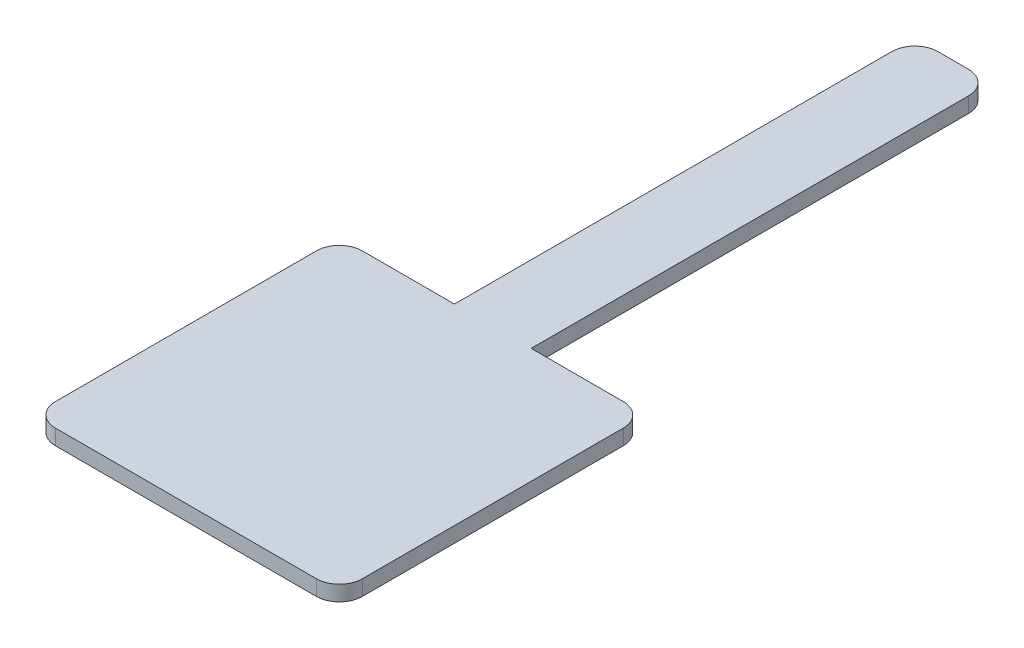
ISO-10303-21;
HEADER;
FILE_DESCRIPTION(('STEP AP214'),'2;1');
FILE_NAME('part.step','',(''),(''),'','','');
FILE_SCHEMA(('AUTOMOTIVE_DESIGN { 1 0 10303 214 1 1 1 1 }'));
ENDSEC;
DATA;
#1=APPLICATION_CONTEXT('core data for automotive mechanical design processes');
#2=APPLICATION_PROTOCOL_DEFINITION('international standard','automotive_design',2000,#1);
#3=PRODUCT_CONTEXT('',#1,'mechanical');
#4=PRODUCT('Part','Part','',(#3));
#5=PRODUCT_RELATED_PRODUCT_CATEGORY('part','',(#4));
#6=PRODUCT_DEFINITION_FORMATION('','',#4);
#7=PRODUCT_DEFINITION_CONTEXT('part definition',#1,'design');
#8=PRODUCT_DEFINITION('design','',#6,#7);
#9=PRODUCT_DEFINITION_SHAPE('','',#8);
#10=(LENGTH_UNIT() NAMED_UNIT(*) SI_UNIT(.MILLI.,.METRE.));
#11=(NAMED_UNIT(*) PLANE_ANGLE_UNIT() SI_UNIT($,.RADIAN.));
#12=(NAMED_UNIT(*) SI_UNIT($,.STERADIAN.) SOLID_ANGLE_UNIT());
#13=UNCERTAINTY_MEASURE_WITH_UNIT(LENGTH_MEASURE(1.E-05),#10,'distance_accuracy_value','');
#14=(GEOMETRIC_REPRESENTATION_CONTEXT(3) GLOBAL_UNCERTAINTY_ASSIGNED_CONTEXT((#13)) GLOBAL_UNIT_ASSIGNED_CONTEXT((#10,
#11,#12)) REPRESENTATION_CONTEXT('',''));
#15=CARTESIAN_POINT('',(0.,0.,0.));
#16=DIRECTION('',(0.,0.,1.));
#17=DIRECTION('',(1.,0.,0.));
#18=AXIS2_PLACEMENT_3D('',#15,#16,#17);
#19=CARTESIAN_POINT('',(-24.8040067689601,1.,0.720140696045538));
#20=DIRECTION('',(1.,0.,0.));
#21=DIRECTION('',(0.,0.,-1.));
#22=AXIS2_PLACEMENT_3D('',#19,#20,#21);
#23=PLANE('',#22);
#24=DIRECTION('',(0.,0.,1.));
#25=VECTOR('',#24,1.);
#26=CARTESIAN_POINT('',(-24.8040067689601,1.,0.720140696045538));
#27=LINE('',#26,#25);
#28=CARTESIAN_POINT('',(-24.8040067689601,1.,2.22014069604554));
#29=VERTEX_POINT('',#28);
#30=CARTESIAN_POINT('',(-24.8040067689601,1.,19.2201406960455));
#31=VERTEX_POINT('',#30);
#32=EDGE_CURVE('E213',#29,#31,#27,.T.);
#33=ORIENTED_EDGE('',*,*,#32,.F.);
#34=DIRECTION('',(0.,-1.,0.));
#35=VECTOR('',#34,1.);
#36=CARTESIAN_POINT('',(-24.8040067689601,1.,2.22014069604554));
#37=LINE('',#36,#35);
#38=CARTESIAN_POINT('',(-24.8040067689601,0.,2.22014069604554));
#39=VERTEX_POINT('',#38);
#40=EDGE_CURVE('E267',#29,#39,#37,.T.);
#41=ORIENTED_EDGE('',*,*,#40,.T.);
#42=DIRECTION('',(0.,0.,1.));
#43=VECTOR('',#42,1.);
#44=CARTESIAN_POINT('',(-24.8040067689601,0.,0.720140696045538));
#45=LINE('',#44,#43);
#46=CARTESIAN_POINT('',(-24.8040067689601,0.,19.2201406960455));
#47=VERTEX_POINT('',#46);
#48=EDGE_CURVE('E186',#39,#47,#45,.T.);
#49=ORIENTED_EDGE('',*,*,#48,.T.);
#50=DIRECTION('',(0.,-1.,0.));
#51=VECTOR('',#50,1.);
#52=CARTESIAN_POINT('',(-24.8040067689601,1.,19.2201406960455));
#53=LINE('',#52,#51);
#54=EDGE_CURVE('E264',#47,#31,#53,.F.);
#55=ORIENTED_EDGE('',*,*,#54,.T.);
#56=EDGE_LOOP('',(#33,#41,#49,#55));
#57=FACE_BOUND('',#56,.T.);
#58=ADVANCED_FACE('F43',(#57),#23,.F.);
#59=CARTESIAN_POINT('',(-24.8040067689601,1.,20.7201406960455));
#60=DIRECTION('',(0.,0.,-1.));
#61=DIRECTION('',(-1.,0.,0.));
#62=AXIS2_PLACEMENT_3D('',#59,#60,#61);
#63=PLANE('',#62);
#64=DIRECTION('',(1.,0.,0.));
#65=VECTOR('',#64,1.);
#66=CARTESIAN_POINT('',(-24.8040067689601,0.,20.7201406960455));
#67=LINE('',#66,#65);
#68=CARTESIAN_POINT('',(-23.3040067689601,0.,20.7201406960455));
#69=VERTEX_POINT('',#68);
#70=CARTESIAN_POINT('',(-6.30400676896015,0.,20.7201406960455));
#71=VERTEX_POINT('',#70);
#72=EDGE_CURVE('E190',#69,#71,#67,.T.);
#73=ORIENTED_EDGE('',*,*,#72,.T.);
#74=DIRECTION('',(0.,-1.,0.));
#75=VECTOR('',#74,1.);
#76=CARTESIAN_POINT('',(-6.30400676896015,1.,20.7201406960455));
#77=LINE('',#76,#75);
#78=CARTESIAN_POINT('',(-6.30400676896015,1.,20.7201406960455));
#79=VERTEX_POINT('',#78);
#80=EDGE_CURVE('E11',#71,#79,#77,.F.);
#81=ORIENTED_EDGE('',*,*,#80,.T.);
#82=DIRECTION('',(1.,0.,0.));
#83=VECTOR('',#82,1.);
#84=CARTESIAN_POINT('',(-24.8040067689601,1.,20.7201406960455));
#85=LINE('',#84,#83);
#86=CARTESIAN_POINT('',(-23.3040067689601,1.,20.7201406960455));
#87=VERTEX_POINT('',#86);
#88=EDGE_CURVE('E291',#87,#79,#85,.T.);
#89=ORIENTED_EDGE('',*,*,#88,.F.);
#90=DIRECTION('',(0.,-1.,0.));
#91=VECTOR('',#90,1.);
#92=CARTESIAN_POINT('',(-23.3040067689601,1.,20.7201406960455));
#93=LINE('',#92,#91);
#94=EDGE_CURVE('E52',#87,#69,#93,.T.);
#95=ORIENTED_EDGE('',*,*,#94,.T.);
#96=EDGE_LOOP('',(#73,#81,#89,#95));
#97=FACE_BOUND('',#96,.T.);
#98=ADVANCED_FACE('F288',(#97),#63,.F.);
#99=CARTESIAN_POINT('',(-4.80400676896015,1.,20.7201406960455));
#100=DIRECTION('',(-1.,0.,0.));
#101=DIRECTION('',(0.,0.,1.));
#102=AXIS2_PLACEMENT_3D('',#99,#100,#101);
#103=PLANE('',#102);
#104=DIRECTION('',(0.,0.,-1.));
#105=VECTOR('',#104,1.);
#106=CARTESIAN_POINT('',(-4.80400676896015,0.,20.7201406960455));
#107=LINE('',#106,#105);
#108=CARTESIAN_POINT('',(-4.80400676896015,0.,19.2201406960455));
#109=VERTEX_POINT('',#108);
#110=CARTESIAN_POINT('',(-4.80400676896015,0.,2.22014069604554));
#111=VERTEX_POINT('',#110);
#112=EDGE_CURVE('E194',#109,#111,#107,.T.);
#113=ORIENTED_EDGE('',*,*,#112,.T.);
#114=DIRECTION('',(0.,-1.,0.));
#115=VECTOR('',#114,1.);
#116=CARTESIAN_POINT('',(-4.80400676896015,1.,2.22014069604554));
#117=LINE('',#116,#115);
#118=CARTESIAN_POINT('',(-4.80400676896015,1.,2.22014069604554));
#119=VERTEX_POINT('',#118);
#120=EDGE_CURVE('E280',#111,#119,#117,.F.);
#121=ORIENTED_EDGE('',*,*,#120,.T.);
#122=DIRECTION('',(0.,0.,-1.));
#123=VECTOR('',#122,1.);
#124=CARTESIAN_POINT('',(-4.80400676896015,1.,20.7201406960455));
#125=LINE('',#124,#123);
#126=CARTESIAN_POINT('',(-4.80400676896015,1.,19.2201406960455));
#127=VERTEX_POINT('',#126);
#128=EDGE_CURVE('E160',#127,#119,#125,.T.);
#129=ORIENTED_EDGE('',*,*,#128,.F.);
#130=DIRECTION('',(0.,-1.,0.));
#131=VECTOR('',#130,1.);
#132=CARTESIAN_POINT('',(-4.80400676896015,1.,19.2201406960455));
#133=LINE('',#132,#131);
#134=EDGE_CURVE('E276',#127,#109,#133,.T.);
#135=ORIENTED_EDGE('',*,*,#134,.T.);
#136=EDGE_LOOP('',(#113,#121,#129,#135));
#137=FACE_BOUND('',#136,.T.);
#138=ADVANCED_FACE('F305',(#137),#103,.F.);
#139=CARTESIAN_POINT('',(-4.80400676896015,1.,0.720140696045538));
#140=DIRECTION('',(0.,0.,1.));
#141=DIRECTION('',(1.,0.,0.));
#142=AXIS2_PLACEMENT_3D('',#139,#140,#141);
#143=PLANE('',#142);
#144=DIRECTION('',(-1.,0.,0.));
#145=VECTOR('',#144,1.);
#146=CARTESIAN_POINT('',(-4.80400676896015,1.,0.720140696045538));
#147=LINE('',#146,#145);
#148=CARTESIAN_POINT('',(-6.30400676896015,1.,0.720140696045538));
#149=VERTEX_POINT('',#148);
#150=CARTESIAN_POINT('',(-12.3040067689601,1.,0.720140696045539));
#151=VERTEX_POINT('',#150);
#152=EDGE_CURVE('E147',#149,#151,#147,.T.);
#153=ORIENTED_EDGE('',*,*,#152,.F.);
#154=DIRECTION('',(0.,-1.,0.));
#155=VECTOR('',#154,1.);
#156=CARTESIAN_POINT('',(-6.30400676896015,1.,0.720140696045538));
#157=LINE('',#156,#155);
#158=CARTESIAN_POINT('',(-6.30400676896015,0.,0.720140696045538));
#159=VERTEX_POINT('',#158);
#160=EDGE_CURVE('E273',#149,#159,#157,.T.);
#161=ORIENTED_EDGE('',*,*,#160,.T.);
#162=DIRECTION('',(-1.,0.,0.));
#163=VECTOR('',#162,1.);
#164=CARTESIAN_POINT('',(-4.80400676896015,0.,0.720140696045538));
#165=LINE('',#164,#163);
#166=CARTESIAN_POINT('',(-12.3040067689601,0.,0.720140696045539));
#167=VERTEX_POINT('',#166);
#168=EDGE_CURVE('E166',#159,#167,#165,.T.);
#169=ORIENTED_EDGE('',*,*,#168,.T.);
#170=DIRECTION('',(0.,-1.,0.));
#171=VECTOR('',#170,1.);
#172=CARTESIAN_POINT('',(-12.3040067689601,1.,0.720140696045539));
#173=LINE('',#172,#171);
#174=EDGE_CURVE('E163',#151,#167,#173,.T.);
#175=ORIENTED_EDGE('',*,*,#174,.F.);
#176=EDGE_LOOP('',(#153,#161,#169,#175));
#177=FACE_BOUND('',#176,.T.);
#178=ADVANCED_FACE('F164',(#177),#143,.F.);
#179=CARTESIAN_POINT('',(-12.3040067689601,1.,0.720140696045539));
#180=DIRECTION('',(-1.,0.,0.));
#181=DIRECTION('',(0.,0.,1.));
#182=AXIS2_PLACEMENT_3D('',#179,#180,#181);
#183=PLANE('',#182);
#184=DIRECTION('',(0.,0.,-1.));
#185=VECTOR('',#184,1.);
#186=CARTESIAN_POINT('',(-12.3040067689601,0.,0.720140696045539));
#187=LINE('',#186,#185);
#188=CARTESIAN_POINT('',(-12.3040067689601,0.,-27.7798593039545));
#189=VERTEX_POINT('',#188);
#190=EDGE_CURVE('E200',#167,#189,#187,.T.);
#191=ORIENTED_EDGE('',*,*,#190,.T.);
#192=DIRECTION('',(0.,-1.,0.));
#193=VECTOR('',#192,1.);
#194=CARTESIAN_POINT('',(-12.3040067689601,1.,-27.7798593039545));
#195=LINE('',#194,#193);
#196=CARTESIAN_POINT('',(-12.3040067689601,1.,-27.7798593039545));
#197=VERTEX_POINT('',#196);
#198=EDGE_CURVE('E67',#189,#197,#195,.F.);
#199=ORIENTED_EDGE('',*,*,#198,.T.);
#200=DIRECTION('',(0.,0.,-1.));
#201=VECTOR('',#200,1.);
#202=CARTESIAN_POINT('',(-12.3040067689601,1.,0.720140696045539));
#203=LINE('',#202,#201);
#204=EDGE_CURVE('E151',#151,#197,#203,.T.);
#205=ORIENTED_EDGE('',*,*,#204,.F.);
#206=ORIENTED_EDGE('',*,*,#174,.T.);
#207=EDGE_LOOP('',(#191,#199,#205,#206));
#208=FACE_BOUND('',#207,.T.);
#209=ADVANCED_FACE('F172',(#208),#183,.F.);
#210=CARTESIAN_POINT('',(-12.3040067689601,1.,-29.2798593039545));
#211=DIRECTION('',(0.,0.,1.));
#212=DIRECTION('',(1.,0.,0.));
#213=AXIS2_PLACEMENT_3D('',#210,#211,#212);
#214=PLANE('',#213);
#215=DIRECTION('',(-1.,0.,0.));
#216=VECTOR('',#215,1.);
#217=CARTESIAN_POINT('',(-12.3040067689601,0.,-29.2798593039545));
#218=LINE('',#217,#216);
#219=CARTESIAN_POINT('',(-13.8040067689601,0.,-29.2798593039545));
#220=VERTEX_POINT('',#219);
#221=CARTESIAN_POINT('',(-15.8040067689601,0.,-29.2798593039545));
#222=VERTEX_POINT('',#221);
#223=EDGE_CURVE('E203',#220,#222,#218,.T.);
#224=ORIENTED_EDGE('',*,*,#223,.T.);
#225=DIRECTION('',(0.,-1.,0.));
#226=VECTOR('',#225,1.);
#227=CARTESIAN_POINT('',(-15.8040067689601,1.,-29.2798593039545));
#228=LINE('',#227,#226);
#229=CARTESIAN_POINT('',(-15.8040067689601,1.,-29.2798593039545));
#230=VERTEX_POINT('',#229);
#231=EDGE_CURVE('E242',#222,#230,#228,.F.);
#232=ORIENTED_EDGE('',*,*,#231,.T.);
#233=DIRECTION('',(-1.,0.,0.));
#234=VECTOR('',#233,1.);
#235=CARTESIAN_POINT('',(-12.3040067689601,1.,-29.2798593039545));
#236=LINE('',#235,#234);
#237=CARTESIAN_POINT('',(-13.8040067689601,1.,-29.2798593039545));
#238=VERTEX_POINT('',#237);
#239=EDGE_CURVE('E174',#238,#230,#236,.T.);
#240=ORIENTED_EDGE('',*,*,#239,.F.);
#241=DIRECTION('',(0.,-1.,0.));
#242=VECTOR('',#241,1.);
#243=CARTESIAN_POINT('',(-13.8040067689601,1.,-29.2798593039545));
#244=LINE('',#243,#242);
#245=EDGE_CURVE('E238',#238,#220,#244,.T.);
#246=ORIENTED_EDGE('',*,*,#245,.T.);
#247=EDGE_LOOP('',(#224,#232,#240,#246));
#248=FACE_BOUND('',#247,.T.);
#249=ADVANCED_FACE('F359',(#248),#214,.F.);
#250=CARTESIAN_POINT('',(-17.3040067689601,1.,-29.2798593039545));
#251=DIRECTION('',(1.,0.,0.));
#252=DIRECTION('',(0.,0.,-1.));
#253=AXIS2_PLACEMENT_3D('',#250,#251,#252);
#254=PLANE('',#253);
#255=DIRECTION('',(0.,0.,1.));
#256=VECTOR('',#255,1.);
#257=CARTESIAN_POINT('',(-17.3040067689601,1.,-29.2798593039545));
#258=LINE('',#257,#256);
#259=CARTESIAN_POINT('',(-17.3040067689601,1.,-27.7798593039545));
#260=VERTEX_POINT('',#259);
#261=CARTESIAN_POINT('',(-17.3040067689601,1.,0.720140696045538));
#262=VERTEX_POINT('',#261);
#263=EDGE_CURVE('E177',#260,#262,#258,.T.);
#264=ORIENTED_EDGE('',*,*,#263,.F.);
#265=DIRECTION('',(0.,-1.,0.));
#266=VECTOR('',#265,1.);
#267=CARTESIAN_POINT('',(-17.3040067689601,1.,-27.7798593039545));
#268=LINE('',#267,#266);
#269=CARTESIAN_POINT('',(-17.3040067689601,0.,-27.7798593039545));
#270=VERTEX_POINT('',#269);
#271=EDGE_CURVE('E169',#260,#270,#268,.T.);
#272=ORIENTED_EDGE('',*,*,#271,.T.);
#273=DIRECTION('',(0.,0.,1.));
#274=VECTOR('',#273,1.);
#275=CARTESIAN_POINT('',(-17.3040067689601,0.,-29.2798593039545));
#276=LINE('',#275,#274);
#277=CARTESIAN_POINT('',(-17.3040067689601,0.,0.720140696045538));
#278=VERTEX_POINT('',#277);
#279=EDGE_CURVE('E207',#270,#278,#276,.T.);
#280=ORIENTED_EDGE('',*,*,#279,.T.);
#281=DIRECTION('',(0.,-1.,0.));
#282=VECTOR('',#281,1.);
#283=CARTESIAN_POINT('',(-17.3040067689601,1.,0.720140696045538));
#284=LINE('',#283,#282);
#285=EDGE_CURVE('E170',#262,#278,#284,.T.);
#286=ORIENTED_EDGE('',*,*,#285,.F.);
#287=EDGE_LOOP('',(#264,#272,#280,#286));
#288=FACE_BOUND('',#287,.T.);
#289=ADVANCED_FACE('F356',(#288),#254,.F.);
#290=CARTESIAN_POINT('',(-17.3040067689601,1.,0.720140696045538));
#291=DIRECTION('',(0.,0.,1.));
#292=DIRECTION('',(1.,0.,0.));
#293=AXIS2_PLACEMENT_3D('',#290,#291,#292);
#294=PLANE('',#293);
#295=DIRECTION('',(-1.,0.,0.));
#296=VECTOR('',#295,1.);
#297=CARTESIAN_POINT('',(-17.3040067689601,0.,0.720140696045538));
#298=LINE('',#297,#296);
#299=CARTESIAN_POINT('',(-23.3040067689601,0.,0.720140696045538));
#300=VERTEX_POINT('',#299);
#301=EDGE_CURVE('E210',#278,#300,#298,.T.);
#302=ORIENTED_EDGE('',*,*,#301,.T.);
#303=DIRECTION('',(0.,-1.,0.));
#304=VECTOR('',#303,1.);
#305=CARTESIAN_POINT('',(-23.3040067689601,1.,0.720140696045538));
#306=LINE('',#305,#304);
#307=CARTESIAN_POINT('',(-23.3040067689601,1.,0.720140696045538));
#308=VERTEX_POINT('',#307);
#309=EDGE_CURVE('E59',#300,#308,#306,.F.);
#310=ORIENTED_EDGE('',*,*,#309,.T.);
#311=DIRECTION('',(-1.,0.,0.));
#312=VECTOR('',#311,1.);
#313=CARTESIAN_POINT('',(-17.3040067689601,1.,0.720140696045538));
#314=LINE('',#313,#312);
#315=EDGE_CURVE('E183',#262,#308,#314,.T.);
#316=ORIENTED_EDGE('',*,*,#315,.F.);
#317=ORIENTED_EDGE('',*,*,#285,.T.);
#318=EDGE_LOOP('',(#302,#310,#316,#317));
#319=FACE_BOUND('',#318,.T.);
#320=ADVANCED_FACE('F320',(#319),#294,.F.);
#321=CARTESIAN_POINT('',(0.,1.,0.));
#322=DIRECTION('',(0.,1.,0.));
#323=DIRECTION('',(0.,0.,1.));
#324=AXIS2_PLACEMENT_3D('',#321,#322,#323);
#325=PLANE('',#324);
#326=ORIENTED_EDGE('',*,*,#239,.T.);
#327=CARTESIAN_POINT('',(-15.8040067689601,1.,-27.7798593039545));
#328=DIRECTION('',(0.,1.,0.));
#329=DIRECTION('',(0.,0.,1.));
#330=AXIS2_PLACEMENT_3D('',#327,#328,#329);
#331=CIRCLE('',#330,1.5);
#332=EDGE_CURVE('E259',#230,#260,#331,.T.);
#333=ORIENTED_EDGE('',*,*,#332,.T.);
#334=ORIENTED_EDGE('',*,*,#263,.T.);
#335=ORIENTED_EDGE('',*,*,#315,.T.);
#336=CARTESIAN_POINT('',(-23.3040067689601,1.,2.22014069604554));
#337=DIRECTION('',(0.,1.,0.));
#338=DIRECTION('',(0.,0.,1.));
#339=AXIS2_PLACEMENT_3D('',#336,#337,#338);
#340=CIRCLE('',#339,1.5);
#341=EDGE_CURVE('E253',#308,#29,#340,.T.);
#342=ORIENTED_EDGE('',*,*,#341,.T.);
#343=ORIENTED_EDGE('',*,*,#32,.T.);
#344=CARTESIAN_POINT('',(-23.3040067689601,1.,19.2201406960455));
#345=DIRECTION('',(0.,1.,0.));
#346=DIRECTION('',(0.,0.,1.));
#347=AXIS2_PLACEMENT_3D('',#344,#345,#346);
#348=CIRCLE('',#347,1.5);
#349=EDGE_CURVE('E245',#31,#87,#348,.T.);
#350=ORIENTED_EDGE('',*,*,#349,.T.);
#351=ORIENTED_EDGE('',*,*,#88,.T.);
#352=CARTESIAN_POINT('',(-6.30400676896015,1.,19.2201406960455));
#353=DIRECTION('',(0.,1.,0.));
#354=DIRECTION('',(0.,0.,1.));
#355=AXIS2_PLACEMENT_3D('',#352,#353,#354);
#356=CIRCLE('',#355,1.5);
#357=EDGE_CURVE('E248',#79,#127,#356,.T.);
#358=ORIENTED_EDGE('',*,*,#357,.T.);
#359=ORIENTED_EDGE('',*,*,#128,.T.);
#360=CARTESIAN_POINT('',(-6.30400676896015,1.,2.22014069604554));
#361=DIRECTION('',(0.,1.,0.));
#362=DIRECTION('',(0.,0.,1.));
#363=AXIS2_PLACEMENT_3D('',#360,#361,#362);
#364=CIRCLE('',#363,1.5);
#365=EDGE_CURVE('E155',#119,#149,#364,.T.);
#366=ORIENTED_EDGE('',*,*,#365,.T.);
#367=ORIENTED_EDGE('',*,*,#152,.T.);
#368=ORIENTED_EDGE('',*,*,#204,.T.);
#369=CARTESIAN_POINT('',(-13.8040067689601,1.,-27.7798593039545));
#370=DIRECTION('',(0.,1.,0.));
#371=DIRECTION('',(0.,0.,1.));
#372=AXIS2_PLACEMENT_3D('',#369,#370,#371);
#373=CIRCLE('',#372,1.5);
#374=EDGE_CURVE('E256',#197,#238,#373,.T.);
#375=ORIENTED_EDGE('',*,*,#374,.T.);
#376=EDGE_LOOP('',(#326,#333,#334,#335,#342,#343,#350,#351,#358,#359,#366,#367,#368,#375));
#377=FACE_BOUND('',#376,.T.);
#378=ADVANCED_FACE('F150',(#377),#325,.T.);
#379=CARTESIAN_POINT('',(0.,0.,0.));
#380=DIRECTION('',(0.,1.,0.));
#381=DIRECTION('',(0.,0.,1.));
#382=AXIS2_PLACEMENT_3D('',#379,#380,#381);
#383=PLANE('',#382);
#384=ORIENTED_EDGE('',*,*,#279,.F.);
#385=CARTESIAN_POINT('',(-15.8040067689601,0.,-27.7798593039545));
#386=DIRECTION('',(0.,1.,0.));
#387=DIRECTION('',(0.,0.,1.));
#388=AXIS2_PLACEMENT_3D('',#385,#386,#387);
#389=CIRCLE('',#388,1.5);
#390=EDGE_CURVE('E235',#270,#222,#389,.F.);
#391=ORIENTED_EDGE('',*,*,#390,.T.);
#392=ORIENTED_EDGE('',*,*,#223,.F.);
#393=CARTESIAN_POINT('',(-13.8040067689601,0.,-27.7798593039545));
#394=DIRECTION('',(0.,1.,0.));
#395=DIRECTION('',(0.,0.,1.));
#396=AXIS2_PLACEMENT_3D('',#393,#394,#395);
#397=CIRCLE('',#396,1.5);
#398=EDGE_CURVE('E232',#220,#189,#397,.F.);
#399=ORIENTED_EDGE('',*,*,#398,.T.);
#400=ORIENTED_EDGE('',*,*,#190,.F.);
#401=ORIENTED_EDGE('',*,*,#168,.F.);
#402=CARTESIAN_POINT('',(-6.30400676896015,0.,2.22014069604554));
#403=DIRECTION('',(0.,1.,0.));
#404=DIRECTION('',(0.,0.,1.));
#405=AXIS2_PLACEMENT_3D('',#402,#403,#404);
#406=CIRCLE('',#405,1.5);
#407=EDGE_CURVE('E226',#159,#111,#406,.F.);
#408=ORIENTED_EDGE('',*,*,#407,.T.);
#409=ORIENTED_EDGE('',*,*,#112,.F.);
#410=CARTESIAN_POINT('',(-6.30400676896015,0.,19.2201406960455));
#411=DIRECTION('',(0.,1.,0.));
#412=DIRECTION('',(0.,0.,1.));
#413=AXIS2_PLACEMENT_3D('',#410,#411,#412);
#414=CIRCLE('',#413,1.5);
#415=EDGE_CURVE('E223',#109,#71,#414,.F.);
#416=ORIENTED_EDGE('',*,*,#415,.T.);
#417=ORIENTED_EDGE('',*,*,#72,.F.);
#418=CARTESIAN_POINT('',(-23.3040067689601,0.,19.2201406960455));
#419=DIRECTION('',(0.,1.,0.));
#420=DIRECTION('',(0.,0.,1.));
#421=AXIS2_PLACEMENT_3D('',#418,#419,#420);
#422=CIRCLE('',#421,1.5);
#423=EDGE_CURVE('E220',#69,#47,#422,.F.);
#424=ORIENTED_EDGE('',*,*,#423,.T.);
#425=ORIENTED_EDGE('',*,*,#48,.F.);
#426=CARTESIAN_POINT('',(-23.3040067689601,0.,2.22014069604554));
#427=DIRECTION('',(0.,1.,0.));
#428=DIRECTION('',(0.,0.,1.));
#429=AXIS2_PLACEMENT_3D('',#426,#427,#428);
#430=CIRCLE('',#429,1.5);
#431=EDGE_CURVE('E229',#39,#300,#430,.F.);
#432=ORIENTED_EDGE('',*,*,#431,.T.);
#433=ORIENTED_EDGE('',*,*,#301,.F.);
#434=EDGE_LOOP('',(#384,#391,#392,#399,#400,#401,#408,#409,#416,#417,#424,#425,#432,#433));
#435=FACE_BOUND('',#434,.T.);
#436=ADVANCED_FACE('F296',(#435),#383,.F.);
#437=CARTESIAN_POINT('',(-15.8040067689601,1.,-27.7798593039545));
#438=DIRECTION('',(0.,-1.,0.));
#439=DIRECTION('',(0.,0.,-1.));
#440=AXIS2_PLACEMENT_3D('',#437,#438,#439);
#441=CYLINDRICAL_SURFACE('',#440,1.5);
#442=ORIENTED_EDGE('',*,*,#332,.F.);
#443=ORIENTED_EDGE('',*,*,#231,.F.);
#444=ORIENTED_EDGE('',*,*,#390,.F.);
#445=ORIENTED_EDGE('',*,*,#271,.F.);
#446=EDGE_LOOP('',(#442,#443,#444,#445));
#447=FACE_BOUND('',#446,.T.);
#448=ADVANCED_FACE('F333',(#447),#441,.T.);
#449=CARTESIAN_POINT('',(-13.8040067689601,1.,-27.7798593039545));
#450=DIRECTION('',(0.,-1.,0.));
#451=DIRECTION('',(0.,0.,-1.));
#452=AXIS2_PLACEMENT_3D('',#449,#450,#451);
#453=CYLINDRICAL_SURFACE('',#452,1.5);
#454=ORIENTED_EDGE('',*,*,#374,.F.);
#455=ORIENTED_EDGE('',*,*,#198,.F.);
#456=ORIENTED_EDGE('',*,*,#398,.F.);
#457=ORIENTED_EDGE('',*,*,#245,.F.);
#458=EDGE_LOOP('',(#454,#455,#456,#457));
#459=FACE_BOUND('',#458,.T.);
#460=ADVANCED_FACE('F325',(#459),#453,.T.);
#461=CARTESIAN_POINT('',(-23.3040067689601,1.,2.22014069604554));
#462=DIRECTION('',(0.,-1.,0.));
#463=DIRECTION('',(0.,0.,-1.));
#464=AXIS2_PLACEMENT_3D('',#461,#462,#463);
#465=CYLINDRICAL_SURFACE('',#464,1.5);
#466=ORIENTED_EDGE('',*,*,#341,.F.);
#467=ORIENTED_EDGE('',*,*,#309,.F.);
#468=ORIENTED_EDGE('',*,*,#431,.F.);
#469=ORIENTED_EDGE('',*,*,#40,.F.);
#470=EDGE_LOOP('',(#466,#467,#468,#469));
#471=FACE_BOUND('',#470,.T.);
#472=ADVANCED_FACE('F322',(#471),#465,.T.);
#473=CARTESIAN_POINT('',(-6.30400676896015,1.,2.22014069604554));
#474=DIRECTION('',(0.,-1.,0.));
#475=DIRECTION('',(0.,0.,-1.));
#476=AXIS2_PLACEMENT_3D('',#473,#474,#475);
#477=CYLINDRICAL_SURFACE('',#476,1.5);
#478=ORIENTED_EDGE('',*,*,#365,.F.);
#479=ORIENTED_EDGE('',*,*,#120,.F.);
#480=ORIENTED_EDGE('',*,*,#407,.F.);
#481=ORIENTED_EDGE('',*,*,#160,.F.);
#482=EDGE_LOOP('',(#478,#479,#480,#481));
#483=FACE_BOUND('',#482,.T.);
#484=ADVANCED_FACE('F324',(#483),#477,.T.);
#485=CARTESIAN_POINT('',(-6.30400676896015,1.,19.2201406960455));
#486=DIRECTION('',(0.,-1.,0.));
#487=DIRECTION('',(0.,0.,-1.));
#488=AXIS2_PLACEMENT_3D('',#485,#486,#487);
#489=CYLINDRICAL_SURFACE('',#488,1.5);
#490=ORIENTED_EDGE('',*,*,#357,.F.);
#491=ORIENTED_EDGE('',*,*,#80,.F.);
#492=ORIENTED_EDGE('',*,*,#415,.F.);
#493=ORIENTED_EDGE('',*,*,#134,.F.);
#494=EDGE_LOOP('',(#490,#491,#492,#493));
#495=FACE_BOUND('',#494,.T.);
#496=ADVANCED_FACE('F302',(#495),#489,.T.);
#497=CARTESIAN_POINT('',(-23.3040067689601,1.,19.2201406960455));
#498=DIRECTION('',(0.,-1.,0.));
#499=DIRECTION('',(0.,0.,-1.));
#500=AXIS2_PLACEMENT_3D('',#497,#498,#499);
#501=CYLINDRICAL_SURFACE('',#500,1.5);
#502=ORIENTED_EDGE('',*,*,#349,.F.);
#503=ORIENTED_EDGE('',*,*,#54,.F.);
#504=ORIENTED_EDGE('',*,*,#423,.F.);
#505=ORIENTED_EDGE('',*,*,#94,.F.);
#506=EDGE_LOOP('',(#502,#503,#504,#505));
#507=FACE_BOUND('',#506,.T.);
#508=ADVANCED_FACE('F45',(#507),#501,.T.);
#509=CLOSED_SHELL('',(#58,#98,#138,#178,#209,#249,#289,#320,#378,#436,#448,#460,#472,#484,#496,#508));
#510=MANIFOLD_SOLID_BREP('B2',#509);
#511=ADVANCED_BREP_SHAPE_REPRESENTATION('',(#18,#510),#14);
#512=SHAPE_DEFINITION_REPRESENTATION(#9,#511);
ENDSEC;
END-ISO-10303-21;
